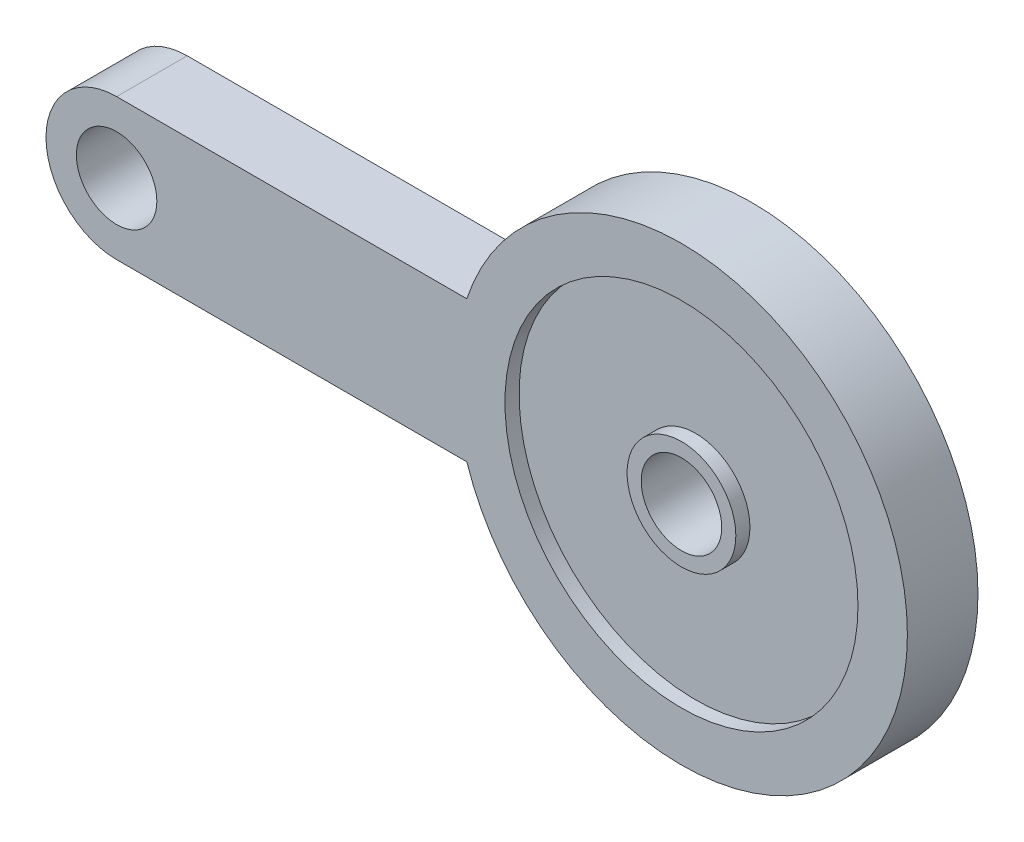
ISO-10303-21;
HEADER;
FILE_DESCRIPTION(('STEP AP214'),'2;1');
FILE_NAME('part.step','',(''),(''),'','','');
FILE_SCHEMA(('AUTOMOTIVE_DESIGN { 1 0 10303 214 1 1 1 1 }'));
ENDSEC;
DATA;
#1=APPLICATION_CONTEXT('core data for automotive mechanical design processes');
#2=APPLICATION_PROTOCOL_DEFINITION('international standard','automotive_design',2000,#1);
#3=PRODUCT_CONTEXT('',#1,'mechanical');
#4=PRODUCT('Part','Part','',(#3));
#5=PRODUCT_RELATED_PRODUCT_CATEGORY('part','',(#4));
#6=PRODUCT_DEFINITION_FORMATION('','',#4);
#7=PRODUCT_DEFINITION_CONTEXT('part definition',#1,'design');
#8=PRODUCT_DEFINITION('design','',#6,#7);
#9=PRODUCT_DEFINITION_SHAPE('','',#8);
#10=(LENGTH_UNIT() NAMED_UNIT(*) SI_UNIT(.MILLI.,.METRE.));
#11=(NAMED_UNIT(*) PLANE_ANGLE_UNIT() SI_UNIT($,.RADIAN.));
#12=(NAMED_UNIT(*) SI_UNIT($,.STERADIAN.) SOLID_ANGLE_UNIT());
#13=UNCERTAINTY_MEASURE_WITH_UNIT(LENGTH_MEASURE(1.E-05),#10,'distance_accuracy_value','');
#14=(GEOMETRIC_REPRESENTATION_CONTEXT(3) GLOBAL_UNCERTAINTY_ASSIGNED_CONTEXT((#13)) GLOBAL_UNIT_ASSIGNED_CONTEXT((#10,
#11,#12)) REPRESENTATION_CONTEXT('',''));
#15=CARTESIAN_POINT('',(0.,0.,0.));
#16=DIRECTION('',(0.,0.,1.));
#17=DIRECTION('',(1.,0.,0.));
#18=AXIS2_PLACEMENT_3D('',#15,#16,#17);
#19=CARTESIAN_POINT('',(20.,0.,1.5));
#20=DIRECTION('',(0.,0.,1.));
#21=DIRECTION('',(1.,0.,0.));
#22=AXIS2_PLACEMENT_3D('',#19,#20,#21);
#23=PLANE('',#22);
#24=CARTESIAN_POINT('',(20.,0.,1.5));
#25=DIRECTION('',(0.,0.,1.));
#26=DIRECTION('',(1.,0.,0.));
#27=AXIS2_PLACEMENT_3D('',#24,#25,#26);
#28=CIRCLE('',#27,12.5);
#29=CARTESIAN_POINT('',(32.5,0.,1.5));
#30=VERTEX_POINT('',#29);
#31=EDGE_CURVE('E86',#30,#30,#28,.T.);
#32=ORIENTED_EDGE('',*,*,#31,.T.);
#33=EDGE_LOOP('',(#32));
#34=FACE_BOUND('',#33,.T.);
#35=CARTESIAN_POINT('',(20.,0.,1.5));
#36=DIRECTION('',(0.,0.,1.));
#37=DIRECTION('',(1.,0.,0.));
#38=AXIS2_PLACEMENT_3D('',#35,#36,#37);
#39=CIRCLE('',#38,3.85);
#40=CARTESIAN_POINT('',(23.85,0.,1.5));
#41=VERTEX_POINT('',#40);
#42=EDGE_CURVE('E131',#41,#41,#39,.F.);
#43=ORIENTED_EDGE('',*,*,#42,.T.);
#44=EDGE_LOOP('',(#43));
#45=FACE_BOUND('',#44,.T.);
#46=ADVANCED_FACE('F40',(#34,#45),#23,.T.);
#47=CARTESIAN_POINT('',(20.,0.,-1.5));
#48=DIRECTION('',(0.,0.,1.));
#49=DIRECTION('',(1.,0.,0.));
#50=AXIS2_PLACEMENT_3D('',#47,#48,#49);
#51=PLANE('',#50);
#52=CARTESIAN_POINT('',(20.,0.,-1.5));
#53=DIRECTION('',(0.,0.,1.));
#54=DIRECTION('',(1.,0.,0.));
#55=AXIS2_PLACEMENT_3D('',#52,#53,#54);
#56=CIRCLE('',#55,12.5);
#57=CARTESIAN_POINT('',(32.5,0.,-1.5));
#58=VERTEX_POINT('',#57);
#59=EDGE_CURVE('E125',#58,#58,#56,.T.);
#60=ORIENTED_EDGE('',*,*,#59,.F.);
#61=EDGE_LOOP('',(#60));
#62=FACE_BOUND('',#61,.T.);
#63=CARTESIAN_POINT('',(20.,0.,-1.5));
#64=DIRECTION('',(0.,0.,1.));
#65=DIRECTION('',(1.,0.,0.));
#66=AXIS2_PLACEMENT_3D('',#63,#64,#65);
#67=CIRCLE('',#66,3.85);
#68=CARTESIAN_POINT('',(23.85,0.,-1.5));
#69=VERTEX_POINT('',#68);
#70=EDGE_CURVE('E11',#69,#69,#67,.F.);
#71=ORIENTED_EDGE('',*,*,#70,.F.);
#72=EDGE_LOOP('',(#71));
#73=FACE_BOUND('',#72,.T.);
#74=ADVANCED_FACE('F160',(#62,#73),#51,.F.);
#75=CARTESIAN_POINT('',(-20.,-5.,2.5));
#76=DIRECTION('',(0.,1.,0.));
#77=DIRECTION('',(-1.,0.,0.));
#78=AXIS2_PLACEMENT_3D('',#75,#76,#77);
#79=PLANE('',#78);
#80=DIRECTION('',(0.,0.,-1.));
#81=VECTOR('',#80,1.);
#82=CARTESIAN_POINT('',(4.80131584642933,-5.,2.5));
#83=LINE('',#82,#81);
#84=CARTESIAN_POINT('',(4.80131584642933,-5.,2.5));
#85=VERTEX_POINT('',#84);
#86=CARTESIAN_POINT('',(4.80131584642933,-5.,-2.5));
#87=VERTEX_POINT('',#86);
#88=EDGE_CURVE('E55',#85,#87,#83,.T.);
#89=ORIENTED_EDGE('',*,*,#88,.F.);
#90=DIRECTION('',(1.,0.,0.));
#91=VECTOR('',#90,1.);
#92=CARTESIAN_POINT('',(-20.,-5.,2.5));
#93=LINE('',#92,#91);
#94=CARTESIAN_POINT('',(-20.,-5.,2.5));
#95=VERTEX_POINT('',#94);
#96=EDGE_CURVE('E111',#95,#85,#93,.T.);
#97=ORIENTED_EDGE('',*,*,#96,.F.);
#98=DIRECTION('',(0.,0.,-1.));
#99=VECTOR('',#98,1.);
#100=CARTESIAN_POINT('',(-20.,-5.,2.5));
#101=LINE('',#100,#99);
#102=CARTESIAN_POINT('',(-20.,-5.,-2.5));
#103=VERTEX_POINT('',#102);
#104=EDGE_CURVE('E102',#95,#103,#101,.T.);
#105=ORIENTED_EDGE('',*,*,#104,.T.);
#106=DIRECTION('',(1.,0.,0.));
#107=VECTOR('',#106,1.);
#108=CARTESIAN_POINT('',(-20.,-5.,-2.5));
#109=LINE('',#108,#107);
#110=EDGE_CURVE('E60',#103,#87,#109,.T.);
#111=ORIENTED_EDGE('',*,*,#110,.T.);
#112=EDGE_LOOP('',(#89,#97,#105,#111));
#113=FACE_BOUND('',#112,.T.);
#114=ADVANCED_FACE('F162',(#113),#79,.F.);
#115=CARTESIAN_POINT('',(-20.,5.,2.5));
#116=DIRECTION('',(0.,-1.,0.));
#117=DIRECTION('',(1.,0.,0.));
#118=AXIS2_PLACEMENT_3D('',#115,#116,#117);
#119=PLANE('',#118);
#120=DIRECTION('',(0.,0.,-1.));
#121=VECTOR('',#120,1.);
#122=CARTESIAN_POINT('',(4.80131584642933,5.,2.5));
#123=LINE('',#122,#121);
#124=CARTESIAN_POINT('',(4.80131584642933,5.,-2.5));
#125=VERTEX_POINT('',#124);
#126=CARTESIAN_POINT('',(4.80131584642933,5.,2.5));
#127=VERTEX_POINT('',#126);
#128=EDGE_CURVE('E48',#125,#127,#123,.F.);
#129=ORIENTED_EDGE('',*,*,#128,.F.);
#130=DIRECTION('',(-1.,0.,0.));
#131=VECTOR('',#130,1.);
#132=CARTESIAN_POINT('',(-20.,5.,-2.5));
#133=LINE('',#132,#131);
#134=CARTESIAN_POINT('',(-20.,5.,-2.5));
#135=VERTEX_POINT('',#134);
#136=EDGE_CURVE('E89',#125,#135,#133,.T.);
#137=ORIENTED_EDGE('',*,*,#136,.T.);
#138=DIRECTION('',(0.,0.,-1.));
#139=VECTOR('',#138,1.);
#140=CARTESIAN_POINT('',(-20.,5.,2.5));
#141=LINE('',#140,#139);
#142=CARTESIAN_POINT('',(-20.,5.,2.5));
#143=VERTEX_POINT('',#142);
#144=EDGE_CURVE('E103',#143,#135,#141,.T.);
#145=ORIENTED_EDGE('',*,*,#144,.F.);
#146=DIRECTION('',(-1.,0.,0.));
#147=VECTOR('',#146,1.);
#148=CARTESIAN_POINT('',(-20.,5.,2.5));
#149=LINE('',#148,#147);
#150=EDGE_CURVE('E101',#127,#143,#149,.T.);
#151=ORIENTED_EDGE('',*,*,#150,.F.);
#152=EDGE_LOOP('',(#129,#137,#145,#151));
#153=FACE_BOUND('',#152,.T.);
#154=ADVANCED_FACE('F100',(#153),#119,.F.);
#155=CARTESIAN_POINT('',(-20.,0.,2.5));
#156=DIRECTION('',(0.,0.,1.));
#157=DIRECTION('',(1.,0.,0.));
#158=AXIS2_PLACEMENT_3D('',#155,#156,#157);
#159=PLANE('',#158);
#160=CARTESIAN_POINT('',(20.,0.,2.5));
#161=DIRECTION('',(0.,0.,1.));
#162=DIRECTION('',(1.,0.,0.));
#163=AXIS2_PLACEMENT_3D('',#160,#161,#162);
#164=CIRCLE('',#163,16.);
#165=EDGE_CURVE('E85',#85,#127,#164,.T.);
#166=ORIENTED_EDGE('',*,*,#165,.T.);
#167=ORIENTED_EDGE('',*,*,#150,.T.);
#168=CARTESIAN_POINT('',(-20.,0.,2.5));
#169=DIRECTION('',(0.,0.,1.));
#170=DIRECTION('',(1.,0.,0.));
#171=AXIS2_PLACEMENT_3D('',#168,#169,#170);
#172=CIRCLE('',#171,5.);
#173=EDGE_CURVE('E97',#143,#95,#172,.T.);
#174=ORIENTED_EDGE('',*,*,#173,.T.);
#175=ORIENTED_EDGE('',*,*,#96,.T.);
#176=EDGE_LOOP('',(#166,#167,#174,#175));
#177=FACE_BOUND('',#176,.T.);
#178=CARTESIAN_POINT('',(20.,0.,2.5));
#179=DIRECTION('',(0.,0.,1.));
#180=DIRECTION('',(1.,0.,0.));
#181=AXIS2_PLACEMENT_3D('',#178,#179,#180);
#182=CIRCLE('',#181,12.5);
#183=CARTESIAN_POINT('',(32.5,0.,2.5));
#184=VERTEX_POINT('',#183);
#185=EDGE_CURVE('E122',#184,#184,#182,.T.);
#186=ORIENTED_EDGE('',*,*,#185,.F.);
#187=EDGE_LOOP('',(#186));
#188=FACE_BOUND('',#187,.T.);
#189=CARTESIAN_POINT('',(-20.,0.,2.5));
#190=DIRECTION('',(0.,0.,1.));
#191=DIRECTION('',(1.,0.,0.));
#192=AXIS2_PLACEMENT_3D('',#189,#190,#191);
#193=CIRCLE('',#192,2.85);
#194=CARTESIAN_POINT('',(-17.15,0.,2.5));
#195=VERTEX_POINT('',#194);
#196=EDGE_CURVE('E109',#195,#195,#193,.T.);
#197=ORIENTED_EDGE('',*,*,#196,.F.);
#198=EDGE_LOOP('',(#197));
#199=FACE_BOUND('',#198,.T.);
#200=ADVANCED_FACE('F191',(#177,#188,#199),#159,.T.);
#201=CARTESIAN_POINT('',(-20.,0.,-2.5));
#202=DIRECTION('',(0.,0.,1.));
#203=DIRECTION('',(1.,0.,0.));
#204=AXIS2_PLACEMENT_3D('',#201,#202,#203);
#205=PLANE('',#204);
#206=CARTESIAN_POINT('',(20.,0.,-2.5));
#207=DIRECTION('',(0.,0.,1.));
#208=DIRECTION('',(1.,0.,0.));
#209=AXIS2_PLACEMENT_3D('',#206,#207,#208);
#210=CIRCLE('',#209,12.5);
#211=CARTESIAN_POINT('',(32.5,0.,-2.5));
#212=VERTEX_POINT('',#211);
#213=EDGE_CURVE('E128',#212,#212,#210,.T.);
#214=ORIENTED_EDGE('',*,*,#213,.T.);
#215=EDGE_LOOP('',(#214));
#216=FACE_BOUND('',#215,.T.);
#217=ORIENTED_EDGE('',*,*,#136,.F.);
#218=CARTESIAN_POINT('',(20.,0.,-2.5));
#219=DIRECTION('',(0.,0.,1.));
#220=DIRECTION('',(1.,0.,0.));
#221=AXIS2_PLACEMENT_3D('',#218,#219,#220);
#222=CIRCLE('',#221,16.);
#223=EDGE_CURVE('E79',#87,#125,#222,.T.);
#224=ORIENTED_EDGE('',*,*,#223,.F.);
#225=ORIENTED_EDGE('',*,*,#110,.F.);
#226=CARTESIAN_POINT('',(-20.,0.,-2.5));
#227=DIRECTION('',(0.,0.,1.));
#228=DIRECTION('',(1.,0.,0.));
#229=AXIS2_PLACEMENT_3D('',#226,#227,#228);
#230=CIRCLE('',#229,5.);
#231=EDGE_CURVE('E93',#135,#103,#230,.T.);
#232=ORIENTED_EDGE('',*,*,#231,.F.);
#233=EDGE_LOOP('',(#217,#224,#225,#232));
#234=FACE_BOUND('',#233,.T.);
#235=CARTESIAN_POINT('',(-20.,0.,-2.5));
#236=DIRECTION('',(0.,0.,1.));
#237=DIRECTION('',(1.,0.,0.));
#238=AXIS2_PLACEMENT_3D('',#235,#236,#237);
#239=CIRCLE('',#238,2.85);
#240=CARTESIAN_POINT('',(-17.15,0.,-2.5));
#241=VERTEX_POINT('',#240);
#242=EDGE_CURVE('E115',#241,#241,#239,.T.);
#243=ORIENTED_EDGE('',*,*,#242,.T.);
#244=EDGE_LOOP('',(#243));
#245=FACE_BOUND('',#244,.T.);
#246=ADVANCED_FACE('F90',(#216,#234,#245),#205,.F.);
#247=CARTESIAN_POINT('',(-20.,0.,2.5));
#248=DIRECTION('',(0.,0.,-1.));
#249=DIRECTION('',(-1.,0.,0.));
#250=AXIS2_PLACEMENT_3D('',#247,#248,#249);
#251=CYLINDRICAL_SURFACE('',#250,5.);
#252=ORIENTED_EDGE('',*,*,#231,.T.);
#253=ORIENTED_EDGE('',*,*,#104,.F.);
#254=ORIENTED_EDGE('',*,*,#173,.F.);
#255=ORIENTED_EDGE('',*,*,#144,.T.);
#256=EDGE_LOOP('',(#252,#253,#254,#255));
#257=FACE_BOUND('',#256,.T.);
#258=ADVANCED_FACE('F42',(#257),#251,.T.);
#259=CARTESIAN_POINT('',(-20.,0.,2.5));
#260=DIRECTION('',(0.,0.,-1.));
#261=DIRECTION('',(-1.,0.,0.));
#262=AXIS2_PLACEMENT_3D('',#259,#260,#261);
#263=CYLINDRICAL_SURFACE('',#262,2.85);
#264=ORIENTED_EDGE('',*,*,#196,.T.);
#265=EDGE_LOOP('',(#264));
#266=FACE_BOUND('',#265,.T.);
#267=ORIENTED_EDGE('',*,*,#242,.F.);
#268=EDGE_LOOP('',(#267));
#269=FACE_BOUND('',#268,.T.);
#270=ADVANCED_FACE('F183',(#266,#269),#263,.F.);
#271=CARTESIAN_POINT('',(20.,0.,2.5));
#272=DIRECTION('',(0.,0.,-1.));
#273=DIRECTION('',(-1.,0.,0.));
#274=AXIS2_PLACEMENT_3D('',#271,#272,#273);
#275=CYLINDRICAL_SURFACE('',#274,16.);
#276=ORIENTED_EDGE('',*,*,#223,.T.);
#277=ORIENTED_EDGE('',*,*,#128,.T.);
#278=ORIENTED_EDGE('',*,*,#165,.F.);
#279=ORIENTED_EDGE('',*,*,#88,.T.);
#280=EDGE_LOOP('',(#276,#277,#278,#279));
#281=FACE_BOUND('',#280,.T.);
#282=ADVANCED_FACE('F81',(#281),#275,.T.);
#283=CARTESIAN_POINT('',(20.,0.,1.5));
#284=DIRECTION('',(0.,0.,1.));
#285=DIRECTION('',(1.,0.,0.));
#286=AXIS2_PLACEMENT_3D('',#283,#284,#285);
#287=CYLINDRICAL_SURFACE('',#286,12.5);
#288=ORIENTED_EDGE('',*,*,#31,.F.);
#289=EDGE_LOOP('',(#288));
#290=FACE_BOUND('',#289,.T.);
#291=ORIENTED_EDGE('',*,*,#185,.T.);
#292=EDGE_LOOP('',(#291));
#293=FACE_BOUND('',#292,.T.);
#294=ADVANCED_FACE('F175',(#290,#293),#287,.F.);
#295=CARTESIAN_POINT('',(20.,0.,-1.5));
#296=DIRECTION('',(0.,0.,-1.));
#297=DIRECTION('',(-1.,0.,0.));
#298=AXIS2_PLACEMENT_3D('',#295,#296,#297);
#299=CYLINDRICAL_SURFACE('',#298,12.5);
#300=ORIENTED_EDGE('',*,*,#59,.T.);
#301=EDGE_LOOP('',(#300));
#302=FACE_BOUND('',#301,.T.);
#303=ORIENTED_EDGE('',*,*,#213,.F.);
#304=EDGE_LOOP('',(#303));
#305=FACE_BOUND('',#304,.T.);
#306=ADVANCED_FACE('F155',(#302,#305),#299,.F.);
#307=CARTESIAN_POINT('',(20.,0.,13.3894444302728));
#308=DIRECTION('',(0.,0.,-1.));
#309=DIRECTION('',(-1.,0.,0.));
#310=AXIS2_PLACEMENT_3D('',#307,#308,#309);
#311=CYLINDRICAL_SURFACE('',#310,3.85);
#312=CARTESIAN_POINT('',(20.,0.,-2.5));
#313=DIRECTION('',(0.,0.,1.));
#314=DIRECTION('',(1.,0.,0.));
#315=AXIS2_PLACEMENT_3D('',#312,#313,#314);
#316=CIRCLE('',#315,3.85);
#317=CARTESIAN_POINT('',(23.85,0.,-2.5));
#318=VERTEX_POINT('',#317);
#319=EDGE_CURVE('E145',#318,#318,#316,.F.);
#320=ORIENTED_EDGE('',*,*,#319,.F.);
#321=EDGE_LOOP('',(#320));
#322=FACE_BOUND('',#321,.T.);
#323=ORIENTED_EDGE('',*,*,#70,.T.);
#324=EDGE_LOOP('',(#323));
#325=FACE_BOUND('',#324,.T.);
#326=ADVANCED_FACE('F152',(#322,#325),#311,.T.);
#327=CARTESIAN_POINT('',(-20.,0.,-2.5));
#328=DIRECTION('',(0.,0.,1.));
#329=DIRECTION('',(1.,0.,0.));
#330=AXIS2_PLACEMENT_3D('',#327,#328,#329);
#331=PLANE('',#330);
#332=ORIENTED_EDGE('',*,*,#319,.T.);
#333=EDGE_LOOP('',(#332));
#334=FACE_BOUND('',#333,.T.);
#335=CARTESIAN_POINT('',(20.,0.,-2.5));
#336=DIRECTION('',(0.,0.,1.));
#337=DIRECTION('',(1.,0.,0.));
#338=AXIS2_PLACEMENT_3D('',#335,#336,#337);
#339=CIRCLE('',#338,2.85);
#340=CARTESIAN_POINT('',(22.85,0.,-2.5));
#341=VERTEX_POINT('',#340);
#342=EDGE_CURVE('E140',#341,#341,#339,.F.);
#343=ORIENTED_EDGE('',*,*,#342,.F.);
#344=EDGE_LOOP('',(#343));
#345=FACE_BOUND('',#344,.T.);
#346=ADVANCED_FACE('F149',(#334,#345),#331,.F.);
#347=CARTESIAN_POINT('',(20.,0.,2.5));
#348=DIRECTION('',(0.,0.,-1.));
#349=DIRECTION('',(-1.,0.,0.));
#350=AXIS2_PLACEMENT_3D('',#347,#348,#349);
#351=CYLINDRICAL_SURFACE('',#350,2.85);
#352=ORIENTED_EDGE('',*,*,#342,.T.);
#353=EDGE_LOOP('',(#352));
#354=FACE_BOUND('',#353,.T.);
#355=CARTESIAN_POINT('',(20.,0.,2.5));
#356=DIRECTION('',(0.,0.,1.));
#357=DIRECTION('',(1.,0.,0.));
#358=AXIS2_PLACEMENT_3D('',#355,#356,#357);
#359=CIRCLE('',#358,2.85);
#360=CARTESIAN_POINT('',(22.85,0.,2.5));
#361=VERTEX_POINT('',#360);
#362=EDGE_CURVE('E137',#361,#361,#359,.T.);
#363=ORIENTED_EDGE('',*,*,#362,.T.);
#364=EDGE_LOOP('',(#363));
#365=FACE_BOUND('',#364,.T.);
#366=ADVANCED_FACE('F184',(#354,#365),#351,.F.);
#367=ORIENTED_EDGE('',*,*,#42,.F.);
#368=EDGE_LOOP('',(#367));
#369=FACE_BOUND('',#368,.T.);
#370=CARTESIAN_POINT('',(20.,0.,2.5));
#371=DIRECTION('',(0.,0.,1.));
#372=DIRECTION('',(1.,0.,0.));
#373=AXIS2_PLACEMENT_3D('',#370,#371,#372);
#374=CIRCLE('',#373,3.85);
#375=CARTESIAN_POINT('',(23.85,0.,2.5));
#376=VERTEX_POINT('',#375);
#377=EDGE_CURVE('E136',#376,#376,#374,.T.);
#378=ORIENTED_EDGE('',*,*,#377,.F.);
#379=EDGE_LOOP('',(#378));
#380=FACE_BOUND('',#379,.T.);
#381=ADVANCED_FACE('F157',(#369,#380),#311,.T.);
#382=CARTESIAN_POINT('',(-20.,0.,2.5));
#383=DIRECTION('',(0.,0.,1.));
#384=DIRECTION('',(1.,0.,0.));
#385=AXIS2_PLACEMENT_3D('',#382,#383,#384);
#386=PLANE('',#385);
#387=ORIENTED_EDGE('',*,*,#362,.F.);
#388=EDGE_LOOP('',(#387));
#389=FACE_BOUND('',#388,.T.);
#390=ORIENTED_EDGE('',*,*,#377,.T.);
#391=EDGE_LOOP('',(#390));
#392=FACE_BOUND('',#391,.T.);
#393=ADVANCED_FACE('F253',(#389,#392),#386,.T.);
#394=CLOSED_SHELL('',(#46,#74,#114,#154,#200,#246,#258,#270,#282,#294,#306,#326,#346,#366,#381,#393));
#395=MANIFOLD_SOLID_BREP('B2',#394);
#396=ADVANCED_BREP_SHAPE_REPRESENTATION('',(#18,#395),#14);
#397=SHAPE_DEFINITION_REPRESENTATION(#9,#396);
ENDSEC;
END-ISO-10303-21;
